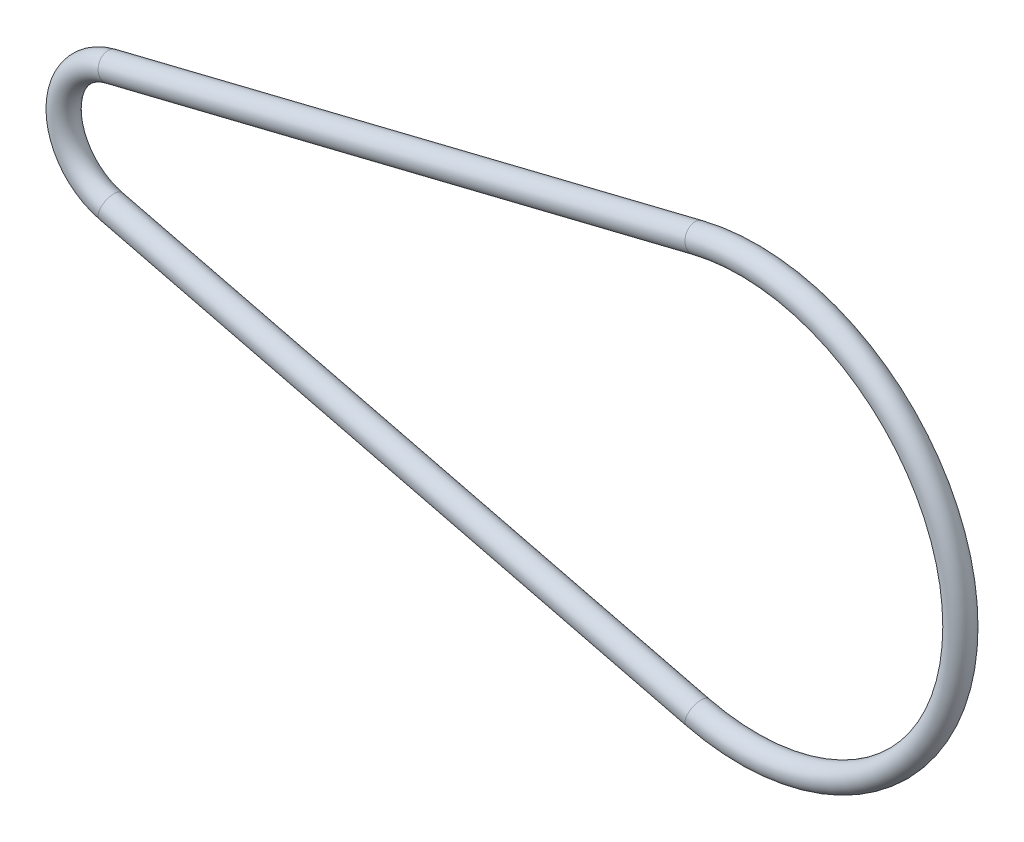
ISO-10303-21;
HEADER;
FILE_DESCRIPTION(('STEP AP214'),'2;1');
FILE_NAME('part.step','',(''),(''),'','','');
FILE_SCHEMA(('AUTOMOTIVE_DESIGN { 1 0 10303 214 1 1 1 1 }'));
ENDSEC;
DATA;
#1=APPLICATION_CONTEXT('core data for automotive mechanical design processes');
#2=APPLICATION_PROTOCOL_DEFINITION('international standard','automotive_design',2000,#1);
#3=PRODUCT_CONTEXT('',#1,'mechanical');
#4=PRODUCT('Part','Part','',(#3));
#5=PRODUCT_RELATED_PRODUCT_CATEGORY('part','',(#4));
#6=PRODUCT_DEFINITION_FORMATION('','',#4);
#7=PRODUCT_DEFINITION_CONTEXT('part definition',#1,'design');
#8=PRODUCT_DEFINITION('design','',#6,#7);
#9=PRODUCT_DEFINITION_SHAPE('','',#8);
#10=(LENGTH_UNIT() NAMED_UNIT(*) SI_UNIT(.MILLI.,.METRE.));
#11=(NAMED_UNIT(*) PLANE_ANGLE_UNIT() SI_UNIT($,.RADIAN.));
#12=(NAMED_UNIT(*) SI_UNIT($,.STERADIAN.) SOLID_ANGLE_UNIT());
#13=UNCERTAINTY_MEASURE_WITH_UNIT(LENGTH_MEASURE(1.E-05),#10,'distance_accuracy_value','');
#14=(GEOMETRIC_REPRESENTATION_CONTEXT(3) GLOBAL_UNCERTAINTY_ASSIGNED_CONTEXT((#13)) GLOBAL_UNIT_ASSIGNED_CONTEXT((#10,
#11,#12)) REPRESENTATION_CONTEXT('',''));
#15=CARTESIAN_POINT('',(0.,0.,0.));
#16=DIRECTION('',(0.,0.,1.));
#17=DIRECTION('',(1.,0.,0.));
#18=AXIS2_PLACEMENT_3D('',#15,#16,#17);
#19=CARTESIAN_POINT('',(50.,0.,0.));
#20=DIRECTION('',(0.,0.,-1.));
#21=DIRECTION('',(-1.,0.,0.));
#22=AXIS2_PLACEMENT_3D('',#19,#20,#21);
#23=TOROIDAL_SURFACE('',#22,17.,1.);
#24=CARTESIAN_POINT('',(45.92,16.5031390953358,0.));
#25=DIRECTION('',(-0.970772887960928,-0.24,0.));
#26=DIRECTION('',(0.24,-0.970772887960928,0.));
#27=AXIS2_PLACEMENT_3D('',#24,#25,#26);
#28=CIRCLE('',#27,1.);
#29=CARTESIAN_POINT('',(45.68,17.4739119832967,0.));
#30=VERTEX_POINT('',#29);
#31=EDGE_CURVE('E59',#30,#30,#28,.T.);
#32=CARTESIAN_POINT('',(45.92,-16.5031390953358,0.));
#33=DIRECTION('',(0.970772887960928,-0.24,0.));
#34=DIRECTION('',(0.24,0.970772887960928,0.));
#35=AXIS2_PLACEMENT_3D('',#32,#33,#34);
#36=CIRCLE('',#35,1.);
#37=CARTESIAN_POINT('',(45.68,-17.4739119832967,0.));
#38=VERTEX_POINT('',#37);
#39=EDGE_CURVE('E55',#38,#38,#36,.T.);
#40=CARTESIAN_POINT('',(50.,0.,0.));
#41=DIRECTION('',(0.,0.,-1.));
#42=DIRECTION('',(-1.,0.,0.));
#43=AXIS2_PLACEMENT_3D('',#40,#41,#42);
#44=CIRCLE('',#43,18.);
#45=EDGE_CURVE('',#30,#38,#44,.T.);
#46=ORIENTED_EDGE('',*,*,#31,.F.);
#47=ORIENTED_EDGE('',*,*,#39,.T.);
#48=ORIENTED_EDGE('',*,*,#45,.T.);
#49=ORIENTED_EDGE('',*,*,#45,.F.);
#50=EDGE_LOOP('',(#46,#48,#47,#49));
#51=FACE_BOUND('',#50,.T.);
#52=ADVANCED_FACE('F44',(#51),#23,.T.);
#53=CARTESIAN_POINT('',(45.92,-16.5031390953358,0.));
#54=DIRECTION('',(-0.970772887960928,0.24,0.));
#55=DIRECTION('',(-0.24,-0.970772887960928,0.));
#56=AXIS2_PLACEMENT_3D('',#53,#54,#55);
#57=CYLINDRICAL_SURFACE('',#56,1.);
#58=CARTESIAN_POINT('',(-1.2,-4.85386443980465,0.));
#59=DIRECTION('',(0.970772887960928,-0.24,0.));
#60=DIRECTION('',(0.24,0.970772887960928,0.));
#61=AXIS2_PLACEMENT_3D('',#58,#59,#60);
#62=CIRCLE('',#61,1.);
#63=CARTESIAN_POINT('',(-1.44,-5.82463732776558,0.));
#64=VERTEX_POINT('',#63);
#65=EDGE_CURVE('E51',#64,#64,#62,.T.);
#66=ORIENTED_EDGE('',*,*,#65,.T.);
#67=EDGE_LOOP('',(#66));
#68=FACE_BOUND('',#67,.T.);
#69=ORIENTED_EDGE('',*,*,#39,.F.);
#70=EDGE_LOOP('',(#69));
#71=FACE_BOUND('',#70,.T.);
#72=ADVANCED_FACE('F68',(#68,#71),#57,.T.);
#73=CARTESIAN_POINT('',(0.,0.,0.));
#74=DIRECTION('',(0.,0.,-1.));
#75=DIRECTION('',(-1.,0.,0.));
#76=AXIS2_PLACEMENT_3D('',#73,#74,#75);
#77=TOROIDAL_SURFACE('',#76,5.00000000000001,1.);
#78=CARTESIAN_POINT('',(-1.19999999999999,4.85386443980464,0.));
#79=DIRECTION('',(-0.970772887960928,-0.24,0.));
#80=DIRECTION('',(0.24,-0.970772887960928,0.));
#81=AXIS2_PLACEMENT_3D('',#78,#79,#80);
#82=CIRCLE('',#81,1.);
#83=CARTESIAN_POINT('',(-1.43999999999999,5.82463732776558,0.));
#84=VERTEX_POINT('',#83);
#85=EDGE_CURVE('E11',#84,#84,#82,.T.);
#86=CARTESIAN_POINT('',(0.,0.,0.));
#87=DIRECTION('',(0.,0.,-1.));
#88=DIRECTION('',(-1.,0.,0.));
#89=AXIS2_PLACEMENT_3D('',#86,#87,#88);
#90=CIRCLE('',#89,6.00000000000001);
#91=EDGE_CURVE('',#64,#84,#90,.T.);
#92=ORIENTED_EDGE('',*,*,#65,.F.);
#93=ORIENTED_EDGE('',*,*,#85,.T.);
#94=ORIENTED_EDGE('',*,*,#91,.T.);
#95=ORIENTED_EDGE('',*,*,#91,.F.);
#96=EDGE_LOOP('',(#92,#94,#93,#95));
#97=FACE_BOUND('',#96,.T.);
#98=ADVANCED_FACE('F74',(#97),#77,.T.);
#99=CARTESIAN_POINT('',(-1.2,4.85386443980464,0.));
#100=DIRECTION('',(0.970772887960928,0.24,0.));
#101=DIRECTION('',(-0.24,0.970772887960928,0.));
#102=AXIS2_PLACEMENT_3D('',#99,#100,#101);
#103=CYLINDRICAL_SURFACE('',#102,1.);
#104=ORIENTED_EDGE('',*,*,#31,.T.);
#105=EDGE_LOOP('',(#104));
#106=FACE_BOUND('',#105,.T.);
#107=ORIENTED_EDGE('',*,*,#85,.F.);
#108=EDGE_LOOP('',(#107));
#109=FACE_BOUND('',#108,.T.);
#110=ADVANCED_FACE('F46',(#106,#109),#103,.T.);
#111=CLOSED_SHELL('',(#52,#72,#98,#110));
#112=MANIFOLD_SOLID_BREP('B2',#111);
#113=ADVANCED_BREP_SHAPE_REPRESENTATION('',(#18,#112),#14);
#114=SHAPE_DEFINITION_REPRESENTATION(#9,#113);
ENDSEC;
END-ISO-10303-21;
